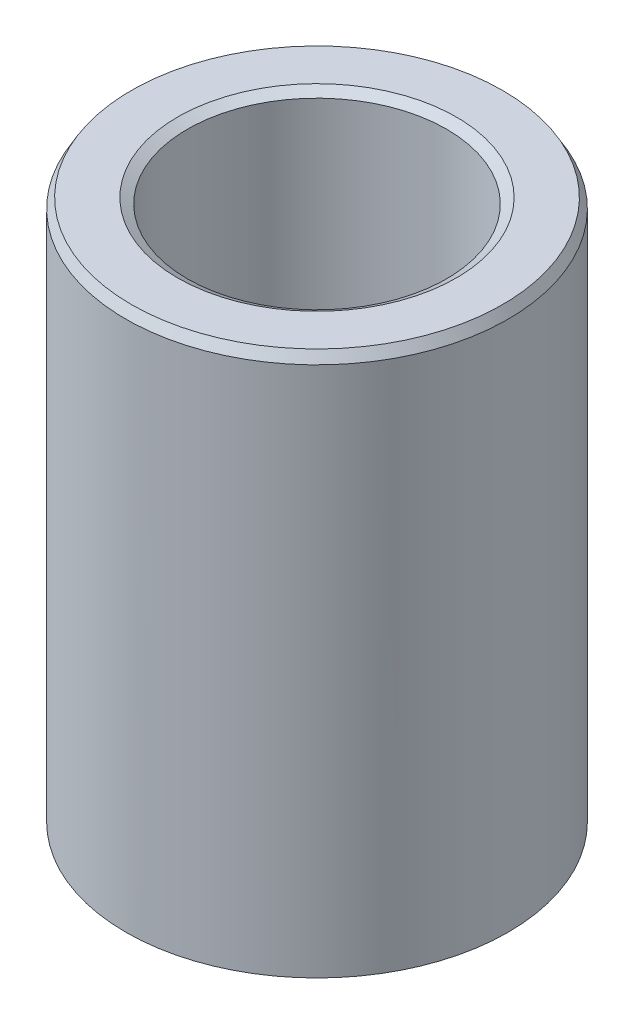
ISO-10303-21;
HEADER;
FILE_DESCRIPTION(('STEP AP214'),'2;1');
FILE_NAME('part.step','',(''),(''),'','','');
FILE_SCHEMA(('AUTOMOTIVE_DESIGN { 1 0 10303 214 1 1 1 1 }'));
ENDSEC;
DATA;
#1=APPLICATION_CONTEXT('core data for automotive mechanical design processes');
#2=APPLICATION_PROTOCOL_DEFINITION('international standard','automotive_design',2000,#1);
#3=PRODUCT_CONTEXT('',#1,'mechanical');
#4=PRODUCT('Part','Part','',(#3));
#5=PRODUCT_RELATED_PRODUCT_CATEGORY('part','',(#4));
#6=PRODUCT_DEFINITION_FORMATION('','',#4);
#7=PRODUCT_DEFINITION_CONTEXT('part definition',#1,'design');
#8=PRODUCT_DEFINITION('design','',#6,#7);
#9=PRODUCT_DEFINITION_SHAPE('','',#8);
#10=(LENGTH_UNIT() NAMED_UNIT(*) SI_UNIT(.MILLI.,.METRE.));
#11=(NAMED_UNIT(*) PLANE_ANGLE_UNIT() SI_UNIT($,.RADIAN.));
#12=(NAMED_UNIT(*) SI_UNIT($,.STERADIAN.) SOLID_ANGLE_UNIT());
#13=UNCERTAINTY_MEASURE_WITH_UNIT(LENGTH_MEASURE(1.E-05),#10,'distance_accuracy_value','');
#14=(GEOMETRIC_REPRESENTATION_CONTEXT(3) GLOBAL_UNCERTAINTY_ASSIGNED_CONTEXT((#13)) GLOBAL_UNIT_ASSIGNED_CONTEXT((#10,
#11,#12)) REPRESENTATION_CONTEXT('',''));
#15=CARTESIAN_POINT('',(0.,0.,0.));
#16=DIRECTION('',(0.,0.,1.));
#17=DIRECTION('',(1.,0.,0.));
#18=AXIS2_PLACEMENT_3D('',#15,#16,#17);
#19=CARTESIAN_POINT('',(0.,100.020881549513,0.));
#20=DIRECTION('',(0.,-1.,0.));
#21=DIRECTION('',(0.,0.,-1.));
#22=AXIS2_PLACEMENT_3D('',#19,#20,#21);
#23=CYLINDRICAL_SURFACE('',#22,35.);
#24=CARTESIAN_POINT('',(0.,1.03312465629589,0.));
#25=DIRECTION('',(0.,1.,0.));
#26=DIRECTION('',(0.,0.,1.));
#27=AXIS2_PLACEMENT_3D('',#24,#25,#26);
#28=CIRCLE('',#27,35.);
#29=CARTESIAN_POINT('',(0.,1.03312465629588,-35.));
#30=VERTEX_POINT('',#29);
#31=EDGE_CURVE('E10',#30,#30,#28,.T.);
#32=CARTESIAN_POINT('',(0.,98.2314571542566,0.));
#33=DIRECTION('',(0.,1.,0.));
#34=DIRECTION('',(0.,0.,1.));
#35=AXIS2_PLACEMENT_3D('',#32,#33,#34);
#36=CIRCLE('',#35,35.);
#37=CARTESIAN_POINT('',(0.,98.2314571542566,-35.));
#38=VERTEX_POINT('',#37);
#39=EDGE_CURVE('E50',#38,#38,#36,.F.);
#40=CARTESIAN_POINT('',(0.,1.03312465629588,-35.));
#41=CARTESIAN_POINT('',(0.,2.04560728648297,-35.));
#42=CARTESIAN_POINT('',(0.,3.05808991667006,-35.));
#43=CARTESIAN_POINT('',(0.,5.08305517704424,-35.));
#44=CARTESIAN_POINT('',(0.,6.09553780723133,-35.));
#45=CARTESIAN_POINT('',(0.,8.12050306760551,-35.));
#46=CARTESIAN_POINT('',(0.,9.1329856977926,-35.));
#47=CARTESIAN_POINT('',(0.,11.1579509581668,-35.));
#48=CARTESIAN_POINT('',(0.,12.1704335883539,-35.));
#49=CARTESIAN_POINT('',(0.,14.1953988487281,-35.));
#50=CARTESIAN_POINT('',(0.,15.2078814789151,-35.));
#51=CARTESIAN_POINT('',(0.,17.2328467392893,-35.));
#52=CARTESIAN_POINT('',(0.,18.2453293694764,-35.));
#53=CARTESIAN_POINT('',(0.,20.2702946298506,-35.));
#54=CARTESIAN_POINT('',(0.,21.2827772600377,-35.));
#55=CARTESIAN_POINT('',(0.,23.3077425204119,-35.));
#56=CARTESIAN_POINT('',(0.,24.320225150599,-35.));
#57=CARTESIAN_POINT('',(0.,26.3451904109731,-35.));
#58=CARTESIAN_POINT('',(0.,27.3576730411602,-35.));
#59=CARTESIAN_POINT('',(0.,29.3826383015344,-35.));
#60=CARTESIAN_POINT('',(0.,30.3951209317215,-35.));
#61=CARTESIAN_POINT('',(0.,32.4200861920957,-35.));
#62=CARTESIAN_POINT('',(0.,33.4325688222828,-35.));
#63=CARTESIAN_POINT('',(0.,35.457534082657,-35.));
#64=CARTESIAN_POINT('',(0.,36.470016712844,-35.));
#65=CARTESIAN_POINT('',(0.,38.4949819732182,-35.));
#66=CARTESIAN_POINT('',(0.,39.5074646034053,-35.));
#67=CARTESIAN_POINT('',(0.,41.5324298637795,-35.));
#68=CARTESIAN_POINT('',(0.,42.5449124939666,-35.));
#69=CARTESIAN_POINT('',(0.,44.5698777543408,-35.));
#70=CARTESIAN_POINT('',(0.,45.5823603845279,-35.));
#71=CARTESIAN_POINT('',(0.,47.607325644902,-35.));
#72=CARTESIAN_POINT('',(0.,48.6198082750891,-35.));
#73=CARTESIAN_POINT('',(0.,50.6447735354633,-35.));
#74=CARTESIAN_POINT('',(0.,51.6572561656504,-35.));
#75=CARTESIAN_POINT('',(0.,53.6822214260246,-35.));
#76=CARTESIAN_POINT('',(0.,54.6947040562117,-35.));
#77=CARTESIAN_POINT('',(0.,56.7196693165859,-35.));
#78=CARTESIAN_POINT('',(0.,57.7321519467729,-35.));
#79=CARTESIAN_POINT('',(0.,59.7571172071471,-35.));
#80=CARTESIAN_POINT('',(0.,60.7695998373342,-35.));
#81=CARTESIAN_POINT('',(0.,62.7945650977084,-35.));
#82=CARTESIAN_POINT('',(0.,63.8070477278955,-35.));
#83=CARTESIAN_POINT('',(0.,65.8320129882697,-35.));
#84=CARTESIAN_POINT('',(0.,66.8444956184567,-35.));
#85=CARTESIAN_POINT('',(0.,68.8694608788309,-35.));
#86=CARTESIAN_POINT('',(0.,69.881943509018,-35.));
#87=CARTESIAN_POINT('',(0.,71.9069087693922,-35.));
#88=CARTESIAN_POINT('',(0.,72.9193913995793,-35.));
#89=CARTESIAN_POINT('',(0.,74.9443566599535,-35.));
#90=CARTESIAN_POINT('',(0.,75.9568392901406,-35.));
#91=CARTESIAN_POINT('',(0.,77.9818045505148,-35.));
#92=CARTESIAN_POINT('',(0.,78.9942871807018,-35.));
#93=CARTESIAN_POINT('',(0.,81.019252441076,-35.));
#94=CARTESIAN_POINT('',(0.,82.0317350712631,-35.));
#95=CARTESIAN_POINT('',(0.,84.0567003316373,-35.));
#96=CARTESIAN_POINT('',(0.,85.0691829618244,-35.));
#97=CARTESIAN_POINT('',(0.,87.0941482221986,-35.));
#98=CARTESIAN_POINT('',(0.,88.1066308523856,-35.));
#99=CARTESIAN_POINT('',(0.,90.1315961127598,-35.));
#100=CARTESIAN_POINT('',(0.,91.1440787429469,-35.));
#101=CARTESIAN_POINT('',(0.,93.1690440033211,-35.));
#102=CARTESIAN_POINT('',(0.,94.1815266335082,-35.));
#103=CARTESIAN_POINT('',(0.,96.2064918938824,-35.));
#104=CARTESIAN_POINT('',(0.,97.2189745240695,-35.));
#105=CARTESIAN_POINT('',(0.,98.2314571542566,-35.));
#106=B_SPLINE_CURVE_WITH_KNOTS('',3,(#40,#41,#42,#43,#44,#45,#46,#47,#48,#49,#50,#51,#52,#53,
#54,#55,#56,#57,#58,#59,#60,#61,#62,#63,#64,#65,#66,#67,#68,#69,#70,#71,#72,#73,#74,#75,#76,#77,
#78,#79,#80,#81,#82,#83,#84,#85,#86,#87,#88,#89,#90,#91,#92,#93,#94,#95,#96,#97,#98,#99,#100,
#101,#102,#103,#104,#105),.UNSPECIFIED.,.F.,.F.,(4,2,2,2,2,2,2,2,2,2,2,2,2,2,2,2,2,2,2,2,2,2,2,
2,2,2,2,2,2,2,2,2,4),(0.,3.03744789056128,6.07489578112254,9.11234367168382,12.1497915622451,
15.1872394528064,18.2246873433676,21.2621352339289,24.2995831244902,27.3370310150514,
30.3744789056127,33.411926796174,36.4493746867353,39.4868225772965,42.5242704678578,
45.5617183584191,48.5991662489803,51.6366141395416,54.6740620301029,57.7115099206642,
60.7489578112254,63.7864057017867,66.823853592348,69.8613014829092,72.8987493734705,
75.9361972640318,78.9736451545931,82.0110930451543,85.0485409357156,88.0859888262769,
91.1234367168381,94.1608846073994,97.1983324979607),.UNSPECIFIED.);
#107=EDGE_CURVE('BSEAM39',#30,#38,#106,.T.);
#108=ORIENTED_EDGE('',*,*,#31,.T.);
#109=ORIENTED_EDGE('',*,*,#39,.T.);
#110=ORIENTED_EDGE('',*,*,#107,.T.);
#111=ORIENTED_EDGE('',*,*,#107,.F.);
#112=EDGE_LOOP('',(#108,#110,#109,#111));
#113=FACE_BOUND('',#112,.T.);
#114=ADVANCED_FACE('F39',(#113),#23,.T.);
#115=CARTESIAN_POINT('',(0.,100.020881549513,0.));
#116=DIRECTION('',(0.,1.,0.));
#117=DIRECTION('',(0.,0.,1.));
#118=AXIS2_PLACEMENT_3D('',#115,#116,#117);
#119=PLANE('',#118);
#120=CARTESIAN_POINT('',(0.,100.020881549513,0.));
#121=DIRECTION('',(0.,1.,0.));
#122=DIRECTION('',(0.,0.,1.));
#123=AXIS2_PLACEMENT_3D('',#120,#121,#122);
#124=CIRCLE('',#123,25.5192889866454);
#125=CARTESIAN_POINT('',(0.,100.020881549513,25.5192889866454));
#126=VERTEX_POINT('',#125);
#127=EDGE_CURVE('E58',#126,#126,#124,.F.);
#128=ORIENTED_EDGE('',*,*,#127,.T.);
#129=EDGE_LOOP('',(#128));
#130=FACE_BOUND('',#129,.T.);
#131=CARTESIAN_POINT('',(0.,100.020881549513,0.));
#132=DIRECTION('',(0.,1.,0.));
#133=DIRECTION('',(0.,0.,1.));
#134=AXIS2_PLACEMENT_3D('',#131,#132,#133);
#135=CIRCLE('',#134,33.9668753437042);
#136=CARTESIAN_POINT('',(0.,100.020881549513,33.9668753437042));
#137=VERTEX_POINT('',#136);
#138=EDGE_CURVE('E61',#137,#137,#135,.T.);
#139=ORIENTED_EDGE('',*,*,#138,.T.);
#140=EDGE_LOOP('',(#139));
#141=FACE_BOUND('',#140,.T.);
#142=ADVANCED_FACE('F88',(#130,#141),#119,.T.);
#143=CARTESIAN_POINT('',(0.,0.,0.));
#144=DIRECTION('',(0.,1.,0.));
#145=DIRECTION('',(0.,0.,1.));
#146=AXIS2_PLACEMENT_3D('',#143,#144,#145);
#147=PLANE('',#146);
#148=CARTESIAN_POINT('',(0.,0.,0.));
#149=DIRECTION('',(0.,1.,0.));
#150=DIRECTION('',(0.,0.,1.));
#151=AXIS2_PLACEMENT_3D('',#148,#149,#150);
#152=CIRCLE('',#151,24.7629892476846);
#153=CARTESIAN_POINT('',(0.,0.,24.7629892476846));
#154=VERTEX_POINT('',#153);
#155=EDGE_CURVE('E51',#154,#154,#152,.T.);
#156=ORIENTED_EDGE('',*,*,#155,.T.);
#157=EDGE_LOOP('',(#156));
#158=FACE_BOUND('',#157,.T.);
#159=CARTESIAN_POINT('',(0.,0.,0.));
#160=DIRECTION('',(0.,1.,0.));
#161=DIRECTION('',(0.,0.,1.));
#162=AXIS2_PLACEMENT_3D('',#159,#160,#161);
#163=CIRCLE('',#162,33.2105756047434);
#164=CARTESIAN_POINT('',(0.,0.,33.2105756047434));
#165=VERTEX_POINT('',#164);
#166=EDGE_CURVE('E54',#165,#165,#163,.F.);
#167=ORIENTED_EDGE('',*,*,#166,.T.);
#168=EDGE_LOOP('',(#167));
#169=FACE_BOUND('',#168,.T.);
#170=ADVANCED_FACE('F83',(#158,#169),#147,.F.);
#171=CARTESIAN_POINT('',(0.,100.020881549513,0.));
#172=DIRECTION('',(0.,-1.,0.));
#173=DIRECTION('',(0.,0.,-1.));
#174=AXIS2_PLACEMENT_3D('',#171,#172,#173);
#175=CYLINDRICAL_SURFACE('',#174,23.7298645913887);
#176=CARTESIAN_POINT('',(0.,98.9877568932171,0.));
#177=DIRECTION('',(0.,1.,0.));
#178=DIRECTION('',(0.,0.,1.));
#179=AXIS2_PLACEMENT_3D('',#176,#177,#178);
#180=CIRCLE('',#179,23.7298645913887);
#181=CARTESIAN_POINT('',(0.,98.9877568932171,-23.7298645913887));
#182=VERTEX_POINT('',#181);
#183=EDGE_CURVE('E67',#182,#182,#180,.T.);
#184=CARTESIAN_POINT('',(0.,1.78942439525656,0.));
#185=DIRECTION('',(0.,1.,0.));
#186=DIRECTION('',(0.,0.,1.));
#187=AXIS2_PLACEMENT_3D('',#184,#185,#186);
#188=CIRCLE('',#187,23.7298645913887);
#189=CARTESIAN_POINT('',(0.,1.78942439525656,-23.7298645913887));
#190=VERTEX_POINT('',#189);
#191=EDGE_CURVE('E69',#190,#190,#188,.F.);
#192=CARTESIAN_POINT('',(0.,98.9877568932171,-23.7298645913887));
#193=CARTESIAN_POINT('',(0.,97.97527426303,-23.7298645913887));
#194=CARTESIAN_POINT('',(0.,96.9627916328429,-23.7298645913887));
#195=CARTESIAN_POINT('',(0.,94.9378263724687,-23.7298645913887));
#196=CARTESIAN_POINT('',(0.,93.9253437422816,-23.7298645913887));
#197=CARTESIAN_POINT('',(0.,91.9003784819075,-23.7298645913887));
#198=CARTESIAN_POINT('',(0.,90.8878958517204,-23.7298645913887));
#199=CARTESIAN_POINT('',(0.,88.8629305913462,-23.7298645913887));
#200=CARTESIAN_POINT('',(0.,87.8504479611591,-23.7298645913887));
#201=CARTESIAN_POINT('',(0.,85.8254827007849,-23.7298645913887));
#202=CARTESIAN_POINT('',(0.,84.8130000705978,-23.7298645913887));
#203=CARTESIAN_POINT('',(0.,82.7880348102236,-23.7298645913887));
#204=CARTESIAN_POINT('',(0.,81.7755521800366,-23.7298645913887));
#205=CARTESIAN_POINT('',(0.,79.7505869196624,-23.7298645913887));
#206=CARTESIAN_POINT('',(0.,78.7381042894753,-23.7298645913887));
#207=CARTESIAN_POINT('',(0.,76.7131390291011,-23.7298645913887));
#208=CARTESIAN_POINT('',(0.,75.700656398914,-23.7298645913887));
#209=CARTESIAN_POINT('',(0.,73.6756911385398,-23.7298645913887));
#210=CARTESIAN_POINT('',(0.,72.6632085083528,-23.7298645913887));
#211=CARTESIAN_POINT('',(0.,70.6382432479786,-23.7298645913887));
#212=CARTESIAN_POINT('',(0.,69.6257606177915,-23.7298645913887));
#213=CARTESIAN_POINT('',(0.,67.6007953574173,-23.7298645913887));
#214=CARTESIAN_POINT('',(0.,66.5883127272302,-23.7298645913887));
#215=CARTESIAN_POINT('',(0.,64.5633474668561,-23.7298645913887));
#216=CARTESIAN_POINT('',(0.,63.550864836669,-23.7298645913887));
#217=CARTESIAN_POINT('',(0.,61.5258995762948,-23.7298645913887));
#218=CARTESIAN_POINT('',(0.,60.5134169461077,-23.7298645913887));
#219=CARTESIAN_POINT('',(0.,58.4884516857335,-23.7298645913887));
#220=CARTESIAN_POINT('',(0.,57.4759690555464,-23.7298645913887));
#221=CARTESIAN_POINT('',(0.,55.4510037951723,-23.7298645913887));
#222=CARTESIAN_POINT('',(0.,54.4385211649852,-23.7298645913887));
#223=CARTESIAN_POINT('',(0.,52.413555904611,-23.7298645913887));
#224=CARTESIAN_POINT('',(0.,51.4010732744239,-23.7298645913887));
#225=CARTESIAN_POINT('',(0.,49.3761080140497,-23.7298645913887));
#226=CARTESIAN_POINT('',(0.,48.3636253838626,-23.7298645913887));
#227=CARTESIAN_POINT('',(0.,46.3386601234885,-23.7298645913887));
#228=CARTESIAN_POINT('',(0.,45.3261774933014,-23.7298645913887));
#229=CARTESIAN_POINT('',(0.,43.3012122329272,-23.7298645913887));
#230=CARTESIAN_POINT('',(0.,42.2887296027401,-23.7298645913887));
#231=CARTESIAN_POINT('',(0.,40.2637643423659,-23.7298645913887));
#232=CARTESIAN_POINT('',(0.,39.2512817121788,-23.7298645913887));
#233=CARTESIAN_POINT('',(0.,37.2263164518047,-23.7298645913887));
#234=CARTESIAN_POINT('',(0.,36.2138338216176,-23.7298645913887));
#235=CARTESIAN_POINT('',(0.,34.1888685612434,-23.7298645913887));
#236=CARTESIAN_POINT('',(0.,33.1763859310563,-23.7298645913887));
#237=CARTESIAN_POINT('',(0.,31.1514206706821,-23.7298645913887));
#238=CARTESIAN_POINT('',(0.,30.138938040495,-23.7298645913887));
#239=CARTESIAN_POINT('',(0.,28.1139727801209,-23.7298645913887));
#240=CARTESIAN_POINT('',(0.,27.1014901499338,-23.7298645913887));
#241=CARTESIAN_POINT('',(0.,25.0765248895596,-23.7298645913887));
#242=CARTESIAN_POINT('',(0.,24.0640422593725,-23.7298645913887));
#243=CARTESIAN_POINT('',(0.,22.0390769989983,-23.7298645913887));
#244=CARTESIAN_POINT('',(0.,21.0265943688113,-23.7298645913887));
#245=CARTESIAN_POINT('',(0.,19.0016291084371,-23.7298645913887));
#246=CARTESIAN_POINT('',(0.,17.98914647825,-23.7298645913887));
#247=CARTESIAN_POINT('',(0.,15.9641812178758,-23.7298645913887));
#248=CARTESIAN_POINT('',(0.,14.9516985876887,-23.7298645913887));
#249=CARTESIAN_POINT('',(0.,12.9267333273145,-23.7298645913887));
#250=CARTESIAN_POINT('',(0.,11.9142506971274,-23.7298645913887));
#251=CARTESIAN_POINT('',(0.,9.88928543675326,-23.7298645913887));
#252=CARTESIAN_POINT('',(0.,8.87680280656617,-23.7298645913887));
#253=CARTESIAN_POINT('',(0.,6.851837546192,-23.7298645913887));
#254=CARTESIAN_POINT('',(0.,5.83935491600491,-23.7298645913887));
#255=CARTESIAN_POINT('',(0.,3.81438965563074,-23.7298645913887));
#256=CARTESIAN_POINT('',(0.,2.80190702544365,-23.7298645913887));
#257=CARTESIAN_POINT('',(0.,1.78942439525656,-23.7298645913887));
#258=B_SPLINE_CURVE_WITH_KNOTS('',3,(#192,#193,#194,#195,#196,#197,#198,#199,#200,#201,#202,
#203,#204,#205,#206,#207,#208,#209,#210,#211,#212,#213,#214,#215,#216,#217,#218,#219,#220,#221,
#222,#223,#224,#225,#226,#227,#228,#229,#230,#231,#232,#233,#234,#235,#236,#237,#238,#239,#240,
#241,#242,#243,#244,#245,#246,#247,#248,#249,#250,#251,#252,#253,#254,#255,#256,#257),
.UNSPECIFIED.,.F.,.F.,(4,2,2,2,2,2,2,2,2,2,2,2,2,2,2,2,2,2,2,2,2,2,2,2,2,2,2,2,2,2,2,2,4),(0.,
3.03744789056128,6.07489578112254,9.1123436716838,12.1497915622451,15.1872394528063,
18.2246873433676,21.2621352339289,24.2995831244901,27.3370310150514,30.3744789056127,
33.4119267961739,36.4493746867352,39.4868225772965,42.5242704678577,45.561718358419,
48.5991662489803,51.6366141395415,54.6740620301028,57.7115099206641,60.7489578112253,
63.7864057017866,66.8238535923479,69.8613014829091,72.8987493734704,75.9361972640316,
78.9736451545929,82.0110930451542,85.0485409357155,88.0859888262767,91.123436716838,
94.1608846073993,97.1983324979605),.UNSPECIFIED.);
#259=EDGE_CURVE('BSEAM71',#182,#190,#258,.T.);
#260=ORIENTED_EDGE('',*,*,#183,.T.);
#261=ORIENTED_EDGE('',*,*,#191,.T.);
#262=ORIENTED_EDGE('',*,*,#259,.T.);
#263=ORIENTED_EDGE('',*,*,#259,.F.);
#264=EDGE_LOOP('',(#260,#262,#261,#263));
#265=FACE_BOUND('',#264,.T.);
#266=ADVANCED_FACE('F71',(#265),#175,.F.);
#267=CARTESIAN_POINT('',(0.,98.9877568932171,0.));
#268=DIRECTION('',(0.,1.,0.));
#269=DIRECTION('',(0.,0.,1.));
#270=AXIS2_PLACEMENT_3D('',#267,#268,#269);
#271=CONICAL_SURFACE('',#270,23.7298645913887,1.0471975511966);
#272=ORIENTED_EDGE('',*,*,#127,.F.);
#273=EDGE_LOOP('',(#272));
#274=FACE_BOUND('',#273,.T.);
#275=ORIENTED_EDGE('',*,*,#183,.F.);
#276=EDGE_LOOP('',(#275));
#277=FACE_BOUND('',#276,.T.);
#278=ADVANCED_FACE('F77',(#274,#277),#271,.F.);
#279=CARTESIAN_POINT('',(0.,0.,0.));
#280=DIRECTION('',(0.,-1.,0.));
#281=DIRECTION('',(0.,0.,-1.));
#282=AXIS2_PLACEMENT_3D('',#279,#280,#281);
#283=CONICAL_SURFACE('',#282,24.7629892476846,0.523598775598298);
#284=ORIENTED_EDGE('',*,*,#191,.F.);
#285=EDGE_LOOP('',(#284));
#286=FACE_BOUND('',#285,.T.);
#287=ORIENTED_EDGE('',*,*,#155,.F.);
#288=EDGE_LOOP('',(#287));
#289=FACE_BOUND('',#288,.T.);
#290=ADVANCED_FACE('F73',(#286,#289),#283,.F.);
#291=CARTESIAN_POINT('',(0.,1.03312465629589,0.));
#292=DIRECTION('',(0.,1.,0.));
#293=DIRECTION('',(0.,0.,1.));
#294=AXIS2_PLACEMENT_3D('',#291,#292,#293);
#295=CONICAL_SURFACE('',#294,35.,1.04719755119661);
#296=ORIENTED_EDGE('',*,*,#166,.F.);
#297=EDGE_LOOP('',(#296));
#298=FACE_BOUND('',#297,.T.);
#299=ORIENTED_EDGE('',*,*,#31,.F.);
#300=EDGE_LOOP('',(#299));
#301=FACE_BOUND('',#300,.T.);
#302=ADVANCED_FACE('F76',(#298,#301),#295,.T.);
#303=CARTESIAN_POINT('',(0.,100.020881549513,0.));
#304=DIRECTION('',(0.,-1.,0.));
#305=DIRECTION('',(0.,0.,-1.));
#306=AXIS2_PLACEMENT_3D('',#303,#304,#305);
#307=CONICAL_SURFACE('',#306,33.9668753437042,0.523598775598295);
#308=ORIENTED_EDGE('',*,*,#39,.F.);
#309=EDGE_LOOP('',(#308));
#310=FACE_BOUND('',#309,.T.);
#311=ORIENTED_EDGE('',*,*,#138,.F.);
#312=EDGE_LOOP('',(#311));
#313=FACE_BOUND('',#312,.T.);
#314=ADVANCED_FACE('F45',(#310,#313),#307,.T.);
#315=CLOSED_SHELL('',(#114,#142,#170,#266,#278,#290,#302,#314));
#316=MANIFOLD_SOLID_BREP('B2',#315);
#317=ADVANCED_BREP_SHAPE_REPRESENTATION('',(#18,#316),#14);
#318=SHAPE_DEFINITION_REPRESENTATION(#9,#317);
ENDSEC;
END-ISO-10303-21;
